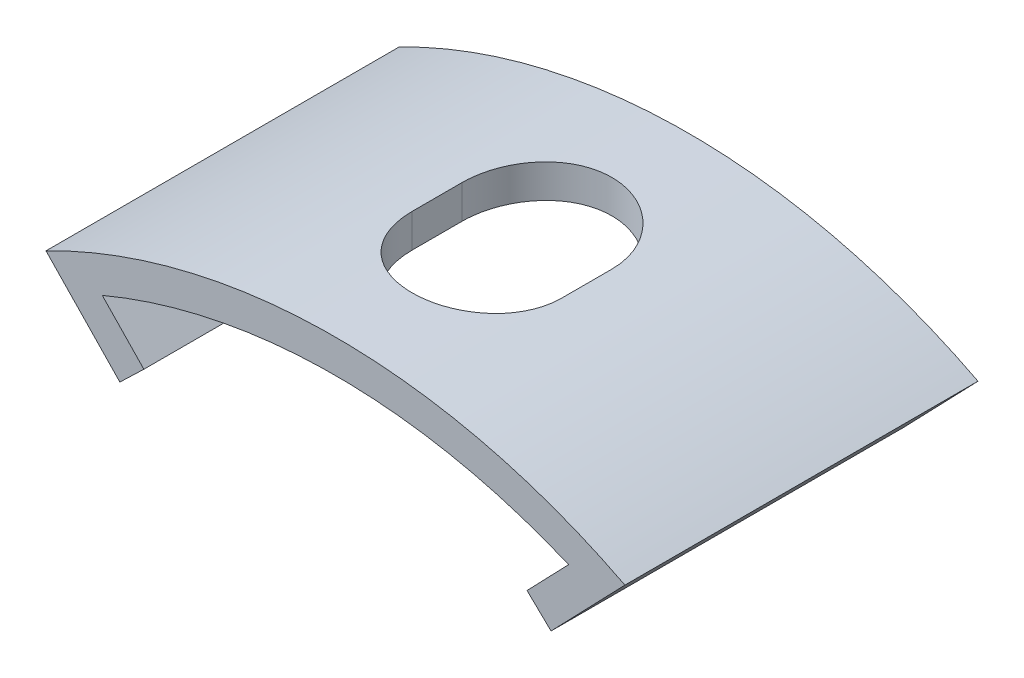
ISO-10303-21;
HEADER;
FILE_DESCRIPTION(('STEP AP214'),'2;1');
FILE_NAME('part.step','',(''),(''),'','','');
FILE_SCHEMA(('AUTOMOTIVE_DESIGN { 1 0 10303 214 1 1 1 1 }'));
ENDSEC;
DATA;
#1=APPLICATION_CONTEXT('core data for automotive mechanical design processes');
#2=APPLICATION_PROTOCOL_DEFINITION('international standard','automotive_design',2000,#1);
#3=PRODUCT_CONTEXT('',#1,'mechanical');
#4=PRODUCT('Part','Part','',(#3));
#5=PRODUCT_RELATED_PRODUCT_CATEGORY('part','',(#4));
#6=PRODUCT_DEFINITION_FORMATION('','',#4);
#7=PRODUCT_DEFINITION_CONTEXT('part definition',#1,'design');
#8=PRODUCT_DEFINITION('design','',#6,#7);
#9=PRODUCT_DEFINITION_SHAPE('','',#8);
#10=(LENGTH_UNIT() NAMED_UNIT(*) SI_UNIT(.MILLI.,.METRE.));
#11=(NAMED_UNIT(*) PLANE_ANGLE_UNIT() SI_UNIT($,.RADIAN.));
#12=(NAMED_UNIT(*) SI_UNIT($,.STERADIAN.) SOLID_ANGLE_UNIT());
#13=UNCERTAINTY_MEASURE_WITH_UNIT(LENGTH_MEASURE(1.E-05),#10,'distance_accuracy_value','');
#14=(GEOMETRIC_REPRESENTATION_CONTEXT(3) GLOBAL_UNCERTAINTY_ASSIGNED_CONTEXT((#13)) GLOBAL_UNIT_ASSIGNED_CONTEXT((#10,
#11,#12)) REPRESENTATION_CONTEXT('',''));
#15=CARTESIAN_POINT('',(0.,0.,0.));
#16=DIRECTION('',(0.,0.,1.));
#17=DIRECTION('',(1.,0.,0.));
#18=AXIS2_PLACEMENT_3D('',#15,#16,#17);
#19=CARTESIAN_POINT('',(0.,0.,5.3));
#20=DIRECTION('',(0.,0.,-1.));
#21=DIRECTION('',(-1.,0.,0.));
#22=AXIS2_PLACEMENT_3D('',#19,#20,#21);
#23=CYLINDRICAL_SURFACE('',#22,18.);
#24=CARTESIAN_POINT('',(0.,0.,-5.3));
#25=DIRECTION('',(0.,0.,1.));
#26=DIRECTION('',(1.,0.,0.));
#27=AXIS2_PLACEMENT_3D('',#24,#25,#26);
#28=CIRCLE('',#27,18.);
#29=CARTESIAN_POINT('',(7.,16.583123951777,-5.3));
#30=VERTEX_POINT('',#29);
#31=CARTESIAN_POINT('',(-7.,16.583123951777,-5.3));
#32=VERTEX_POINT('',#31);
#33=EDGE_CURVE('E227',#30,#32,#28,.T.);
#34=ORIENTED_EDGE('',*,*,#33,.F.);
#35=DIRECTION('',(0.,0.,-1.));
#36=VECTOR('',#35,1.);
#37=CARTESIAN_POINT('',(7.,16.583123951777,5.3));
#38=LINE('',#37,#36);
#39=CARTESIAN_POINT('',(7.,16.583123951777,5.3));
#40=VERTEX_POINT('',#39);
#41=EDGE_CURVE('E248',#40,#30,#38,.T.);
#42=ORIENTED_EDGE('',*,*,#41,.F.);
#43=CARTESIAN_POINT('',(0.,0.,5.3));
#44=DIRECTION('',(0.,0.,1.));
#45=DIRECTION('',(1.,0.,0.));
#46=AXIS2_PLACEMENT_3D('',#43,#44,#45);
#47=CIRCLE('',#46,18.);
#48=CARTESIAN_POINT('',(-7.,16.583123951777,5.3));
#49=VERTEX_POINT('',#48);
#50=EDGE_CURVE('E262',#40,#49,#47,.T.);
#51=ORIENTED_EDGE('',*,*,#50,.T.);
#52=DIRECTION('',(0.,0.,-1.));
#53=VECTOR('',#52,1.);
#54=CARTESIAN_POINT('',(-7.,16.583123951777,5.3));
#55=LINE('',#54,#53);
#56=EDGE_CURVE('E250',#49,#32,#55,.T.);
#57=ORIENTED_EDGE('',*,*,#56,.T.);
#58=EDGE_LOOP('',(#34,#42,#51,#57));
#59=FACE_BOUND('',#58,.T.);
#60=DIRECTION('',(0.,0.,-1.));
#61=VECTOR('',#60,1.);
#62=CARTESIAN_POINT('',(-2.25,17.858821349686,5.3));
#63=LINE('',#62,#61);
#64=CARTESIAN_POINT('',(-2.25,17.858821349686,-0.75));
#65=VERTEX_POINT('',#64);
#66=CARTESIAN_POINT('',(-2.25,17.858821349686,0.75));
#67=VERTEX_POINT('',#66);
#68=EDGE_CURVE('E175',#65,#67,#63,.F.);
#69=ORIENTED_EDGE('',*,*,#68,.T.);
#70=CARTESIAN_POINT('',(-2.25,17.858821349686,0.75));
#71=CARTESIAN_POINT('',(-2.24999987433453,17.8588194251762,0.813038421910983));
#72=CARTESIAN_POINT('',(-2.24734910280741,17.8591555464734,0.876046400447922));
#73=CARTESIAN_POINT('',(-2.2367760280738,17.860483614898,1.00160662816571));
#74=CARTESIAN_POINT('',(-2.22885413082701,17.8614755115204,1.06415891206719));
#75=CARTESIAN_POINT('',(-2.19726613729562,17.8653995354746,1.25031674039511));
#76=CARTESIAN_POINT('',(-2.16577747401027,17.8692801491553,1.37266760263013));
#77=CARTESIAN_POINT('',(-2.08284998220627,17.8791347069465,1.61029050708662));
#78=CARTESIAN_POINT('',(-2.03140462668968,17.8851093358599,1.72556021905842));
#79=CARTESIAN_POINT('',(-1.9100445468626,17.8984759849888,1.94583988541639));
#80=CARTESIAN_POINT('',(-1.8401312637343,17.9058678945916,2.0508506395056));
#81=CARTESIAN_POINT('',(-1.68341206734406,17.9212816202412,2.24819255503716));
#82=CARTESIAN_POINT('',(-1.59652505875848,17.9293063453518,2.34045906512173));
#83=CARTESIAN_POINT('',(-1.4084881592424,17.9450563047993,2.50915218989586));
#84=CARTESIAN_POINT('',(-1.30733609827826,17.9527814933416,2.58557639023872));
#85=CARTESIAN_POINT('',(-1.09323565451996,17.9670912133723,2.72063635035758));
#86=CARTESIAN_POINT('',(-0.980249611183446,17.9736719143119,2.77921284845707));
#87=CARTESIAN_POINT('',(-0.745954846626403,17.9849184109182,2.87653235189302));
#88=CARTESIAN_POINT('',(-0.624646927843693,17.98958439091,2.9152772664524));
#89=CARTESIAN_POINT('',(-0.377817617303712,17.9964554763961,2.97164252706326));
#90=CARTESIAN_POINT('',(-0.252321524361256,17.9986733000917,2.98937208399253));
#91=CARTESIAN_POINT('',(-0.000113958053788392,18.0004416380206,3.00354192890028));
#92=CARTESIAN_POINT('',(0.126597496892533,17.9999921926125,2.9999825390033));
#93=CARTESIAN_POINT('',(0.376889084753837,17.996486825208,2.97176228226685));
#94=CARTESIAN_POINT('',(0.500482760825345,17.9934454852649,2.94721946613686));
#95=CARTESIAN_POINT('',(0.741782589261214,17.9851144748259,2.87791368788275));
#96=CARTESIAN_POINT('',(0.859488661703709,17.9798247738188,2.83315045135721));
#97=CARTESIAN_POINT('',(1.08604033017171,17.9675661901284,2.72454804183679));
#98=CARTESIAN_POINT('',(1.19486100591024,17.9605927880744,2.66065741466114));
#99=CARTESIAN_POINT('',(1.40027581309508,17.9457473888532,2.51565390113486));
#100=CARTESIAN_POINT('',(1.49686990014344,17.9378753884233,2.43454095224834));
#101=CARTESIAN_POINT('',(1.67577600776006,17.9220509715218,2.25674697940169));
#102=CARTESIAN_POINT('',(1.75798787566357,17.9140983698413,2.15996517270914));
#103=CARTESIAN_POINT('',(1.90504051240019,17.8990587520914,1.95388697055325));
#104=CARTESIAN_POINT('',(1.96987611791605,17.8919719936451,1.84458686904738));
#105=CARTESIAN_POINT('',(2.08034030367041,17.8794655923308,1.61647074802186));
#106=CARTESIAN_POINT('',(2.12594942241975,17.8740476401532,1.49764523072224));
#107=CARTESIAN_POINT('',(2.19647134414845,17.8655197697751,1.25402518960859));
#108=CARTESIAN_POINT('',(2.22141531410094,17.8624063766198,1.12923995593975));
#109=CARTESIAN_POINT('',(2.24045955676342,17.860021010604,0.961297341119165));
#110=CARTESIAN_POINT('',(2.24403891993201,17.8595714574598,0.919080958189035));
#111=CARTESIAN_POINT('',(2.24880594188023,17.8589719767877,0.834582343684646));
#112=CARTESIAN_POINT('',(2.2499976086946,17.8588215471485,0.792300341894064));
#113=CARTESIAN_POINT('',(2.25,17.858821349686,0.75));
#114=B_SPLINE_CURVE_WITH_KNOTS('',3,(#70,#71,#72,#73,#74,#75,#76,#77,#78,#79,#80,#81,#82,#83,
#84,#85,#86,#87,#88,#89,#90,#91,#92,#93,#94,#95,#96,#97,#98,#99,#100,#101,#102,#103,#104,#105,
#106,#107,#108,#109,#110,#111,#112,#113),.UNSPECIFIED.,.F.,.F.,(4,2,2,2,2,2,2,2,2,2,2,2,2,2,2,2,
2,2,2,2,2,4),(0.,0.188998328147948,0.377982102132345,0.755226013918386,1.13259341054784,
1.50993136724195,1.88911828117894,2.2683629402761,2.6488534582724,3.02930733885574,
3.40777531688837,3.78623756831039,4.16258453387273,4.53893660680898,4.91631033520017,
5.29368543389454,5.6735920154572,6.05361136055525,6.43401445159375,6.81384277259916,
6.94090357256708,7.06775090645285),.UNSPECIFIED.);
#115=CARTESIAN_POINT('',(2.25,17.858821349686,0.75));
#116=VERTEX_POINT('',#115);
#117=EDGE_CURVE('E140',#67,#116,#114,.T.);
#118=ORIENTED_EDGE('',*,*,#117,.T.);
#119=DIRECTION('',(0.,0.,-1.));
#120=VECTOR('',#119,1.);
#121=CARTESIAN_POINT('',(2.25,17.858821349686,5.3));
#122=LINE('',#121,#120);
#123=CARTESIAN_POINT('',(2.25,17.858821349686,-0.75));
#124=VERTEX_POINT('',#123);
#125=EDGE_CURVE('E174',#116,#124,#122,.T.);
#126=ORIENTED_EDGE('',*,*,#125,.T.);
#127=CARTESIAN_POINT('',(2.25,17.858821349686,-0.75));
#128=CARTESIAN_POINT('',(2.24999987433453,17.8588194251762,-0.813038421910983));
#129=CARTESIAN_POINT('',(2.24734910280741,17.8591555464734,-0.876046400447922));
#130=CARTESIAN_POINT('',(2.2367760280738,17.860483614898,-1.00160662816571));
#131=CARTESIAN_POINT('',(2.22885413082701,17.8614755115204,-1.06415891206719));
#132=CARTESIAN_POINT('',(2.19726613729562,17.8653995354746,-1.25031674039511));
#133=CARTESIAN_POINT('',(2.16577747401027,17.8692801491553,-1.37266760263013));
#134=CARTESIAN_POINT('',(2.08284998220627,17.8791347069465,-1.61029050708662));
#135=CARTESIAN_POINT('',(2.03140462668968,17.8851093358599,-1.72556021905842));
#136=CARTESIAN_POINT('',(1.91004454686259,17.8984759849888,-1.94583988541639));
#137=CARTESIAN_POINT('',(1.8401312637343,17.9058678945916,-2.0508506395056));
#138=CARTESIAN_POINT('',(1.68341206734406,17.9212816202412,-2.24819255503716));
#139=CARTESIAN_POINT('',(1.59652505875848,17.9293063453518,-2.34045906512173));
#140=CARTESIAN_POINT('',(1.4084881592424,17.9450563047993,-2.50915218989586));
#141=CARTESIAN_POINT('',(1.30733609827826,17.9527814933416,-2.58557639023872));
#142=CARTESIAN_POINT('',(1.09323565451996,17.9670912133723,-2.72063635035758));
#143=CARTESIAN_POINT('',(0.980249611183446,17.9736719143119,-2.77921284845707));
#144=CARTESIAN_POINT('',(0.745954846626401,17.9849184109182,-2.87653235189302));
#145=CARTESIAN_POINT('',(0.624646927843692,17.98958439091,-2.9152772664524));
#146=CARTESIAN_POINT('',(0.377817617303711,17.9964554763961,-2.97164252706327));
#147=CARTESIAN_POINT('',(0.252321524361255,17.9986733000917,-2.98937208399253));
#148=CARTESIAN_POINT('',(0.000113958053786956,18.0004416380206,-3.00354192890028));
#149=CARTESIAN_POINT('',(-0.126597496892535,17.9999921926125,-2.9999825390033));
#150=CARTESIAN_POINT('',(-0.376889084753838,17.996486825208,-2.97176228226685));
#151=CARTESIAN_POINT('',(-0.500482760825348,17.9934454852649,-2.94721946613686));
#152=CARTESIAN_POINT('',(-0.741782589261217,17.9851144748259,-2.87791368788275));
#153=CARTESIAN_POINT('',(-0.859488661703711,17.9798247738188,-2.83315045135721));
#154=CARTESIAN_POINT('',(-1.08604033017171,17.9675661901284,-2.72454804183679));
#155=CARTESIAN_POINT('',(-1.19486100591024,17.9605927880744,-2.66065741466114));
#156=CARTESIAN_POINT('',(-1.40027581309508,17.9457473888532,-2.51565390113486));
#157=CARTESIAN_POINT('',(-1.49686990014345,17.9378753884233,-2.43454095224834));
#158=CARTESIAN_POINT('',(-1.67577600776006,17.9220509715218,-2.25674697940169));
#159=CARTESIAN_POINT('',(-1.75798787566357,17.9140983698413,-2.15996517270914));
#160=CARTESIAN_POINT('',(-1.90504051240019,17.8990587520914,-1.95388697055325));
#161=CARTESIAN_POINT('',(-1.96987611791605,17.8919719936451,-1.84458686904739));
#162=CARTESIAN_POINT('',(-2.08034030367041,17.8794655923308,-1.61647074802187));
#163=CARTESIAN_POINT('',(-2.12594942241975,17.8740476401532,-1.49764523072224));
#164=CARTESIAN_POINT('',(-2.19647134414845,17.8655197697751,-1.25402518960859));
#165=CARTESIAN_POINT('',(-2.22141531410094,17.8624063766198,-1.12923995593975));
#166=CARTESIAN_POINT('',(-2.24045955676343,17.860021010604,-0.961297341119165));
#167=CARTESIAN_POINT('',(-2.24403891993201,17.8595714574598,-0.919080958189035));
#168=CARTESIAN_POINT('',(-2.24880594188023,17.8589719767877,-0.834582343684645));
#169=CARTESIAN_POINT('',(-2.24999760869461,17.8588215471485,-0.792300341894064));
#170=CARTESIAN_POINT('',(-2.25,17.858821349686,-0.749999999999999));
#171=B_SPLINE_CURVE_WITH_KNOTS('',3,(#127,#128,#129,#130,#131,#132,#133,#134,#135,#136,#137,
#138,#139,#140,#141,#142,#143,#144,#145,#146,#147,#148,#149,#150,#151,#152,#153,#154,#155,#156,
#157,#158,#159,#160,#161,#162,#163,#164,#165,#166,#167,#168,#169,#170),.UNSPECIFIED.,.F.,.F.,(4,
2,2,2,2,2,2,2,2,2,2,2,2,2,2,2,2,2,2,2,2,4),(0.,0.188998328147948,0.377982102132345,
0.755226013918386,1.13259341054784,1.50993136724195,1.88911828117894,2.2683629402761,
2.6488534582724,3.02930733885574,3.40777531688837,3.78623756831039,4.16258453387273,
4.53893660680899,4.91631033520017,5.29368543389454,5.6735920154572,6.05361136055525,
6.43401445159375,6.81384277259917,6.94090357256708,7.06775090645286),.UNSPECIFIED.);
#172=EDGE_CURVE('E166',#124,#65,#171,.T.);
#173=ORIENTED_EDGE('',*,*,#172,.T.);
#174=EDGE_LOOP('',(#69,#118,#126,#173));
#175=FACE_BOUND('',#174,.T.);
#176=ADVANCED_FACE('F37',(#59,#175),#23,.F.);
#177=CARTESIAN_POINT('',(0.,0.,5.3));
#178=DIRECTION('',(0.,0.,-1.));
#179=DIRECTION('',(-1.,0.,0.));
#180=AXIS2_PLACEMENT_3D('',#177,#178,#179);
#181=CYLINDRICAL_SURFACE('',#180,19.);
#182=CARTESIAN_POINT('',(0.,0.,-5.3));
#183=DIRECTION('',(0.,0.,1.));
#184=DIRECTION('',(1.,0.,0.));
#185=AXIS2_PLACEMENT_3D('',#182,#183,#184);
#186=CIRCLE('',#185,19.);
#187=CARTESIAN_POINT('',(8.68969024076547,16.896428129032,-5.3));
#188=VERTEX_POINT('',#187);
#189=CARTESIAN_POINT('',(-8.68969024076547,16.896428129032,-5.3));
#190=VERTEX_POINT('',#189);
#191=EDGE_CURVE('E212',#188,#190,#186,.T.);
#192=ORIENTED_EDGE('',*,*,#191,.T.);
#193=DIRECTION('',(0.,0.,-1.));
#194=VECTOR('',#193,1.);
#195=CARTESIAN_POINT('',(-8.68969024076547,16.896428129032,5.3));
#196=LINE('',#195,#194);
#197=CARTESIAN_POINT('',(-8.68969024076547,16.896428129032,5.3));
#198=VERTEX_POINT('',#197);
#199=EDGE_CURVE('E239',#198,#190,#196,.T.);
#200=ORIENTED_EDGE('',*,*,#199,.F.);
#201=CARTESIAN_POINT('',(0.,0.,5.3));
#202=DIRECTION('',(0.,0.,1.));
#203=DIRECTION('',(1.,0.,0.));
#204=AXIS2_PLACEMENT_3D('',#201,#202,#203);
#205=CIRCLE('',#204,19.);
#206=CARTESIAN_POINT('',(8.68969024076547,16.896428129032,5.3));
#207=VERTEX_POINT('',#206);
#208=EDGE_CURVE('E223',#207,#198,#205,.T.);
#209=ORIENTED_EDGE('',*,*,#208,.F.);
#210=DIRECTION('',(0.,0.,-1.));
#211=VECTOR('',#210,1.);
#212=CARTESIAN_POINT('',(8.68969024076547,16.896428129032,5.3));
#213=LINE('',#212,#211);
#214=EDGE_CURVE('E241',#207,#188,#213,.T.);
#215=ORIENTED_EDGE('',*,*,#214,.T.);
#216=EDGE_LOOP('',(#192,#200,#209,#215));
#217=FACE_BOUND('',#216,.T.);
#218=CARTESIAN_POINT('',(-2.25,18.8663059447259,0.75));
#219=CARTESIAN_POINT('',(-2.24999984413377,18.866304126766,0.813065444008957));
#220=CARTESIAN_POINT('',(-2.24734683038286,18.8666225662772,0.876100456864434));
#221=CARTESIAN_POINT('',(-2.23676461239271,18.8678808036718,1.00171506453087));
#222=CARTESIAN_POINT('',(-2.22883579857183,18.8688205555769,1.06429469269468));
#223=CARTESIAN_POINT('',(-2.19721906511498,18.8725384514377,1.25053881791379));
#224=CARTESIAN_POINT('',(-2.16570059497972,18.876215376971,1.37294884829296));
#225=CARTESIAN_POINT('',(-2.08268940200505,18.8855534165936,1.61068939978139));
#226=CARTESIAN_POINT('',(-2.0311898629049,18.8912152077282,1.72601748941873));
#227=CARTESIAN_POINT('',(-1.9096974928355,18.9038824486064,1.94640209506089));
#228=CARTESIAN_POINT('',(-1.83970632808281,18.9108877772729,2.05145953535055));
#229=CARTESIAN_POINT('',(-1.68285058840054,18.9254914459535,2.2488249331985));
#230=CARTESIAN_POINT('',(-1.59591314397453,18.9330922589904,2.34107477466332));
#231=CARTESIAN_POINT('',(-1.40777799267168,18.9480090918228,2.50972207917964));
#232=CARTESIAN_POINT('',(-1.3065781169975,18.9553250680887,2.5861171269167));
#233=CARTESIAN_POINT('',(-1.09242950974802,18.9688725160587,2.72108165180554));
#234=CARTESIAN_POINT('',(-0.979447124621018,18.975100737433,2.77959808332987));
#235=CARTESIAN_POINT('',(-0.745179993513777,18.985743053388,2.87680195802174));
#236=CARTESIAN_POINT('',(-0.623896020192753,18.9901573165335,2.91549124373732));
#237=CARTESIAN_POINT('',(-0.377065646956689,18.9966571872975,2.97177169513252));
#238=CARTESIAN_POINT('',(-0.251541895868488,18.9987536150932,2.98946092262533));
#239=CARTESIAN_POINT('',(0.000711970235301823,19.0004185383706,3.00354301109507));
#240=CARTESIAN_POINT('',(0.127442071650238,18.9999870623187,2.99993611188586));
#241=CARTESIAN_POINT('',(0.377837656700778,18.9966534829824,2.9716064392706));
#242=CARTESIAN_POINT('',(0.501515328123363,18.9937637890536,2.94698972369523));
#243=CARTESIAN_POINT('',(0.742970891810421,18.9858525077212,2.87750493446024));
#244=CARTESIAN_POINT('',(0.860748713087663,18.9808308946732,2.83263661719752));
#245=CARTESIAN_POINT('',(1.08739417162659,18.9691986105771,2.72380756445231));
#246=CARTESIAN_POINT('',(1.19623924436736,18.9625840719268,2.65980026694911));
#247=CARTESIAN_POINT('',(1.4016780442815,18.9485069935124,2.51454671739229));
#248=CARTESIAN_POINT('',(1.49827179267252,18.9410444552171,2.43330049519482));
#249=CARTESIAN_POINT('',(1.67708146493049,18.9260538253829,2.25529359456109));
#250=CARTESIAN_POINT('',(1.75920752476244,18.9185256093612,2.15844264223406));
#251=CARTESIAN_POINT('',(1.90607611238423,18.9042941674795,1.95224612854428));
#252=CARTESIAN_POINT('',(1.97081344036131,18.8975911887167,1.84289684366567));
#253=CARTESIAN_POINT('',(2.08106902250753,18.8857682243098,1.61471612700434));
#254=CARTESIAN_POINT('',(2.12656907316942,18.8806497392327,1.49587584007561));
#255=CARTESIAN_POINT('',(2.19687527764837,18.872599510043,1.25225438931704));
#256=CARTESIAN_POINT('',(2.22171263247485,18.8696644696046,1.12748248463915));
#257=CARTESIAN_POINT('',(2.2405901012447,18.8674260294376,0.959849720419371));
#258=CARTESIAN_POINT('',(2.24412051000476,18.8670062867246,0.917921350010672));
#259=CARTESIAN_POINT('',(2.24882229454311,18.8664465763562,0.834001213167836));
#260=CARTESIAN_POINT('',(2.24999761940603,18.8663061403527,0.792009671218649));
#261=CARTESIAN_POINT('',(2.25,18.8663059447259,0.75));
#262=B_SPLINE_CURVE_WITH_KNOTS('',3,(#218,#219,#220,#221,#222,#223,#224,#225,#226,#227,#228,
#229,#230,#231,#232,#233,#234,#235,#236,#237,#238,#239,#240,#241,#242,#243,#244,#245,#246,#247,
#248,#249,#250,#251,#252,#253,#254,#255,#256,#257,#258,#259,#260,#261),.UNSPECIFIED.,.F.,.F.,(4,
2,2,2,2,2,2,2,2,2,2,2,2,2,2,2,2,2,2,2,2,4),(0.,0.189079425503063,0.378144860356892,
0.755564078222733,1.13311216071341,1.510626235245,1.88980094259794,2.26903337097799,
2.64938028868305,3.02969185411809,3.40822044347497,3.7867447702622,4.16336952684837,
4.53999881391062,4.91755193870435,5.29510440961777,5.67492510427658,6.05485925190686,
6.4351521165356,6.81486968499599,6.94105757499129,7.06703369118151),.UNSPECIFIED.);
#263=CARTESIAN_POINT('',(-2.25,18.8663059447259,0.75));
#264=VERTEX_POINT('',#263);
#265=CARTESIAN_POINT('',(2.25,18.8663059447259,0.75));
#266=VERTEX_POINT('',#265);
#267=EDGE_CURVE('E11',#264,#266,#262,.T.);
#268=ORIENTED_EDGE('',*,*,#267,.F.);
#269=DIRECTION('',(0.,0.,-1.));
#270=VECTOR('',#269,1.);
#271=CARTESIAN_POINT('',(-2.25,18.8663059447259,5.3));
#272=LINE('',#271,#270);
#273=CARTESIAN_POINT('',(-2.25,18.8663059447259,-0.750000000000001));
#274=VERTEX_POINT('',#273);
#275=EDGE_CURVE('E127',#274,#264,#272,.F.);
#276=ORIENTED_EDGE('',*,*,#275,.F.);
#277=CARTESIAN_POINT('',(2.25,18.8663059447259,-0.75));
#278=CARTESIAN_POINT('',(2.24999984413377,18.866304126766,-0.813065444008957));
#279=CARTESIAN_POINT('',(2.24734683038285,18.8666225662772,-0.876100456864433));
#280=CARTESIAN_POINT('',(2.23676461239271,18.8678808036718,-1.00171506453087));
#281=CARTESIAN_POINT('',(2.22883579857183,18.8688205555769,-1.06429469269468));
#282=CARTESIAN_POINT('',(2.19721906511497,18.8725384514377,-1.25053881791379));
#283=CARTESIAN_POINT('',(2.16570059497971,18.876215376971,-1.37294884829296));
#284=CARTESIAN_POINT('',(2.08268940200505,18.8855534165936,-1.61068939978139));
#285=CARTESIAN_POINT('',(2.0311898629049,18.8912152077282,-1.72601748941873));
#286=CARTESIAN_POINT('',(1.9096974928355,18.9038824486064,-1.94640209506089));
#287=CARTESIAN_POINT('',(1.8397063280828,18.9108877772729,-2.05145953535055));
#288=CARTESIAN_POINT('',(1.68285058840054,18.9254914459535,-2.2488249331985));
#289=CARTESIAN_POINT('',(1.59591314397453,18.9330922589904,-2.34107477466332));
#290=CARTESIAN_POINT('',(1.40777799267168,18.9480090918228,-2.50972207917964));
#291=CARTESIAN_POINT('',(1.30657811699749,18.9553250680887,-2.5861171269167));
#292=CARTESIAN_POINT('',(1.09242950974802,18.9688725160587,-2.72108165180554));
#293=CARTESIAN_POINT('',(0.979447124621017,18.975100737433,-2.77959808332987));
#294=CARTESIAN_POINT('',(0.745179993513776,18.985743053388,-2.87680195802174));
#295=CARTESIAN_POINT('',(0.623896020192752,18.9901573165335,-2.91549124373732));
#296=CARTESIAN_POINT('',(0.377065646956688,18.9966571872975,-2.97177169513252));
#297=CARTESIAN_POINT('',(0.251541895868486,18.9987536150932,-2.98946092262533));
#298=CARTESIAN_POINT('',(-0.000711970235303124,19.0004185383706,-3.00354301109507));
#299=CARTESIAN_POINT('',(-0.127442071650239,18.9999870623187,-2.99993611188586));
#300=CARTESIAN_POINT('',(-0.377837656700779,18.9966534829824,-2.9716064392706));
#301=CARTESIAN_POINT('',(-0.501515328123365,18.9937637890536,-2.94698972369523));
#302=CARTESIAN_POINT('',(-0.742970891810423,18.9858525077212,-2.87750493446024));
#303=CARTESIAN_POINT('',(-0.860748713087664,18.9808308946732,-2.83263661719752));
#304=CARTESIAN_POINT('',(-1.08739417162659,18.9691986105771,-2.72380756445231));
#305=CARTESIAN_POINT('',(-1.19623924436736,18.9625840719268,-2.65980026694912));
#306=CARTESIAN_POINT('',(-1.4016780442815,18.9485069935124,-2.51454671739229));
#307=CARTESIAN_POINT('',(-1.49827179267252,18.9410444552171,-2.43330049519482));
#308=CARTESIAN_POINT('',(-1.67708146493049,18.9260538253829,-2.25529359456109));
#309=CARTESIAN_POINT('',(-1.75920752476244,18.9185256093612,-2.15844264223406));
#310=CARTESIAN_POINT('',(-1.90607611238423,18.9042941674794,-1.95224612854428));
#311=CARTESIAN_POINT('',(-1.97081344036131,18.8975911887167,-1.84289684366567));
#312=CARTESIAN_POINT('',(-2.08106902250753,18.8857682243098,-1.61471612700434));
#313=CARTESIAN_POINT('',(-2.12656907316942,18.8806497392328,-1.49587584007561));
#314=CARTESIAN_POINT('',(-2.19687527764837,18.872599510043,-1.25225438931704));
#315=CARTESIAN_POINT('',(-2.22171263247485,18.8696644696046,-1.12748248463915));
#316=CARTESIAN_POINT('',(-2.24059010124471,18.8674260294376,-0.959849720419372));
#317=CARTESIAN_POINT('',(-2.24412051000476,18.8670062867246,-0.917921350010673));
#318=CARTESIAN_POINT('',(-2.24882229454311,18.8664465763562,-0.834001213167836));
#319=CARTESIAN_POINT('',(-2.24999761940603,18.8663061403527,-0.792009671218648));
#320=CARTESIAN_POINT('',(-2.25,18.8663059447259,-0.749999999999999));
#321=B_SPLINE_CURVE_WITH_KNOTS('',3,(#277,#278,#279,#280,#281,#282,#283,#284,#285,#286,#287,
#288,#289,#290,#291,#292,#293,#294,#295,#296,#297,#298,#299,#300,#301,#302,#303,#304,#305,#306,
#307,#308,#309,#310,#311,#312,#313,#314,#315,#316,#317,#318,#319,#320),.UNSPECIFIED.,.F.,.F.,(4,
2,2,2,2,2,2,2,2,2,2,2,2,2,2,2,2,2,2,2,2,4),(0.,0.189079425503062,0.378144860356892,
0.755564078222733,1.13311216071341,1.510626235245,1.88980094259794,2.26903337097799,
2.64938028868305,3.02969185411809,3.40822044347497,3.7867447702622,4.16336952684837,
4.53999881391062,4.91755193870435,5.29510440961777,5.67492510427658,6.05485925190686,
6.4351521165356,6.814869684996,6.9410575749913,7.06703369118151),.UNSPECIFIED.);
#322=CARTESIAN_POINT('',(2.25,18.8663059447259,-0.75));
#323=VERTEX_POINT('',#322);
#324=EDGE_CURVE('E132',#323,#274,#321,.T.);
#325=ORIENTED_EDGE('',*,*,#324,.F.);
#326=DIRECTION('',(0.,0.,-1.));
#327=VECTOR('',#326,1.);
#328=CARTESIAN_POINT('',(2.25,18.8663059447259,5.3));
#329=LINE('',#328,#327);
#330=EDGE_CURVE('E50',#266,#323,#329,.T.);
#331=ORIENTED_EDGE('',*,*,#330,.F.);
#332=EDGE_LOOP('',(#268,#276,#325,#331));
#333=FACE_BOUND('',#332,.T.);
#334=ADVANCED_FACE('F144',(#217,#333),#181,.T.);
#335=CARTESIAN_POINT('',(-7.72042085561147,15.889586792859,5.3));
#336=DIRECTION('',(0.720420855611469,0.693537158917991,0.));
#337=DIRECTION('',(-0.693537158917991,0.720420855611469,0.));
#338=AXIS2_PLACEMENT_3D('',#335,#336,#337);
#339=PLANE('',#338);
#340=DIRECTION('',(0.693537158917991,-0.720420855611469,0.));
#341=VECTOR('',#340,1.);
#342=CARTESIAN_POINT('',(-7.72042085561147,15.889586792859,-5.3));
#343=LINE('',#342,#341);
#344=CARTESIAN_POINT('',(-6.47205396955908,14.5928292527584,-5.3));
#345=VERTEX_POINT('',#344);
#346=EDGE_CURVE('E191',#190,#345,#343,.T.);
#347=ORIENTED_EDGE('',*,*,#346,.T.);
#348=DIRECTION('',(0.,0.,-1.));
#349=VECTOR('',#348,1.);
#350=CARTESIAN_POINT('',(-6.47205396955908,14.5928292527584,5.3));
#351=LINE('',#350,#349);
#352=CARTESIAN_POINT('',(-6.47205396955908,14.5928292527584,5.3));
#353=VERTEX_POINT('',#352);
#354=EDGE_CURVE('E133',#353,#345,#351,.T.);
#355=ORIENTED_EDGE('',*,*,#354,.F.);
#356=DIRECTION('',(0.693537158917991,-0.720420855611469,0.));
#357=VECTOR('',#356,1.);
#358=CARTESIAN_POINT('',(-7.72042085561147,15.889586792859,5.3));
#359=LINE('',#358,#357);
#360=EDGE_CURVE('E192',#198,#353,#359,.T.);
#361=ORIENTED_EDGE('',*,*,#360,.F.);
#362=ORIENTED_EDGE('',*,*,#199,.T.);
#363=EDGE_LOOP('',(#347,#355,#361,#362));
#364=FACE_BOUND('',#363,.T.);
#365=ADVANCED_FACE('F39',(#364),#339,.F.);
#366=CARTESIAN_POINT('',(-5.75163311394761,15.2863664116764,5.3));
#367=DIRECTION('',(0.693537158917991,-0.720420855611469,0.));
#368=DIRECTION('',(0.720420855611469,0.693537158917991,0.));
#369=AXIS2_PLACEMENT_3D('',#366,#367,#368);
#370=PLANE('',#369);
#371=DIRECTION('',(-0.720420855611469,-0.693537158917991,0.));
#372=VECTOR('',#371,1.);
#373=CARTESIAN_POINT('',(-5.75163311394761,15.2863664116764,-5.3));
#374=LINE('',#373,#372);
#375=CARTESIAN_POINT('',(-5.75163311394761,15.2863664116764,-5.3));
#376=VERTEX_POINT('',#375);
#377=EDGE_CURVE('E215',#376,#345,#374,.T.);
#378=ORIENTED_EDGE('',*,*,#377,.F.);
#379=DIRECTION('',(0.,0.,-1.));
#380=VECTOR('',#379,1.);
#381=CARTESIAN_POINT('',(-5.75163311394761,15.2863664116764,5.3));
#382=LINE('',#381,#380);
#383=CARTESIAN_POINT('',(-5.75163311394761,15.2863664116764,5.3));
#384=VERTEX_POINT('',#383);
#385=EDGE_CURVE('E252',#384,#376,#382,.T.);
#386=ORIENTED_EDGE('',*,*,#385,.F.);
#387=DIRECTION('',(-0.720420855611469,-0.693537158917991,0.));
#388=VECTOR('',#387,1.);
#389=CARTESIAN_POINT('',(-5.75163311394761,15.2863664116764,5.3));
#390=LINE('',#389,#388);
#391=EDGE_CURVE('E257',#384,#353,#390,.T.);
#392=ORIENTED_EDGE('',*,*,#391,.T.);
#393=ORIENTED_EDGE('',*,*,#354,.T.);
#394=EDGE_LOOP('',(#378,#386,#392,#393));
#395=FACE_BOUND('',#394,.T.);
#396=ADVANCED_FACE('F255',(#395),#370,.T.);
#397=CARTESIAN_POINT('',(-7.,16.583123951777,5.3));
#398=DIRECTION('',(0.720420855611469,0.693537158917991,0.));
#399=DIRECTION('',(-0.693537158917991,0.720420855611469,0.));
#400=AXIS2_PLACEMENT_3D('',#397,#398,#399);
#401=PLANE('',#400);
#402=DIRECTION('',(0.693537158917991,-0.720420855611469,0.));
#403=VECTOR('',#402,1.);
#404=CARTESIAN_POINT('',(-7.,16.583123951777,-5.3));
#405=LINE('',#404,#403);
#406=EDGE_CURVE('E220',#32,#376,#405,.T.);
#407=ORIENTED_EDGE('',*,*,#406,.F.);
#408=ORIENTED_EDGE('',*,*,#56,.F.);
#409=DIRECTION('',(0.693537158917991,-0.720420855611469,0.));
#410=VECTOR('',#409,1.);
#411=CARTESIAN_POINT('',(-7.,16.583123951777,5.3));
#412=LINE('',#411,#410);
#413=EDGE_CURVE('E260',#49,#384,#412,.T.);
#414=ORIENTED_EDGE('',*,*,#413,.T.);
#415=ORIENTED_EDGE('',*,*,#385,.T.);
#416=EDGE_LOOP('',(#407,#408,#414,#415));
#417=FACE_BOUND('',#416,.T.);
#418=ADVANCED_FACE('F185',(#417),#401,.T.);
#419=CARTESIAN_POINT('',(7.,16.583123951777,5.3));
#420=DIRECTION('',(-0.720420855611469,0.693537158917991,0.));
#421=DIRECTION('',(-0.693537158917991,-0.720420855611469,0.));
#422=AXIS2_PLACEMENT_3D('',#419,#420,#421);
#423=PLANE('',#422);
#424=DIRECTION('',(0.693537158917991,0.720420855611469,0.));
#425=VECTOR('',#424,1.);
#426=CARTESIAN_POINT('',(7.,16.583123951777,-5.3));
#427=LINE('',#426,#425);
#428=CARTESIAN_POINT('',(5.75163311394762,15.2863664116764,-5.3));
#429=VERTEX_POINT('',#428);
#430=EDGE_CURVE('E230',#429,#30,#427,.T.);
#431=ORIENTED_EDGE('',*,*,#430,.F.);
#432=DIRECTION('',(0.,0.,-1.));
#433=VECTOR('',#432,1.);
#434=CARTESIAN_POINT('',(5.75163311394762,15.2863664116764,5.3));
#435=LINE('',#434,#433);
#436=CARTESIAN_POINT('',(5.75163311394762,15.2863664116764,5.3));
#437=VERTEX_POINT('',#436);
#438=EDGE_CURVE('E246',#437,#429,#435,.T.);
#439=ORIENTED_EDGE('',*,*,#438,.F.);
#440=DIRECTION('',(0.693537158917991,0.720420855611469,0.));
#441=VECTOR('',#440,1.);
#442=CARTESIAN_POINT('',(7.,16.583123951777,5.3));
#443=LINE('',#442,#441);
#444=EDGE_CURVE('E267',#437,#40,#443,.T.);
#445=ORIENTED_EDGE('',*,*,#444,.T.);
#446=ORIENTED_EDGE('',*,*,#41,.T.);
#447=EDGE_LOOP('',(#431,#439,#445,#446));
#448=FACE_BOUND('',#447,.T.);
#449=ADVANCED_FACE('F183',(#448),#423,.T.);
#450=CARTESIAN_POINT('',(6.47205396955909,14.5928292527584,5.3));
#451=DIRECTION('',(-0.693537158917991,-0.720420855611469,0.));
#452=DIRECTION('',(0.720420855611469,-0.693537158917991,0.));
#453=AXIS2_PLACEMENT_3D('',#450,#451,#452);
#454=PLANE('',#453);
#455=DIRECTION('',(-0.720420855611469,0.693537158917991,0.));
#456=VECTOR('',#455,1.);
#457=CARTESIAN_POINT('',(6.47205396955909,14.5928292527584,-5.3));
#458=LINE('',#457,#456);
#459=CARTESIAN_POINT('',(6.47205396955909,14.5928292527584,-5.3));
#460=VERTEX_POINT('',#459);
#461=EDGE_CURVE('E233',#460,#429,#458,.T.);
#462=ORIENTED_EDGE('',*,*,#461,.F.);
#463=DIRECTION('',(0.,0.,-1.));
#464=VECTOR('',#463,1.);
#465=CARTESIAN_POINT('',(6.47205396955909,14.5928292527584,5.3));
#466=LINE('',#465,#464);
#467=CARTESIAN_POINT('',(6.47205396955909,14.5928292527584,5.3));
#468=VERTEX_POINT('',#467);
#469=EDGE_CURVE('E244',#468,#460,#466,.T.);
#470=ORIENTED_EDGE('',*,*,#469,.F.);
#471=DIRECTION('',(-0.720420855611469,0.693537158917991,0.));
#472=VECTOR('',#471,1.);
#473=CARTESIAN_POINT('',(6.47205396955909,14.5928292527584,5.3));
#474=LINE('',#473,#472);
#475=EDGE_CURVE('E270',#468,#437,#474,.T.);
#476=ORIENTED_EDGE('',*,*,#475,.T.);
#477=ORIENTED_EDGE('',*,*,#438,.T.);
#478=EDGE_LOOP('',(#462,#470,#476,#477));
#479=FACE_BOUND('',#478,.T.);
#480=ADVANCED_FACE('F281',(#479),#454,.T.);
#481=CARTESIAN_POINT('',(7.72042085561147,15.889586792859,5.3));
#482=DIRECTION('',(-0.720420855611469,0.693537158917991,0.));
#483=DIRECTION('',(-0.693537158917991,-0.720420855611469,0.));
#484=AXIS2_PLACEMENT_3D('',#481,#482,#483);
#485=PLANE('',#484);
#486=DIRECTION('',(0.693537158917991,0.720420855611469,0.));
#487=VECTOR('',#486,1.);
#488=CARTESIAN_POINT('',(7.72042085561147,15.889586792859,-5.3));
#489=LINE('',#488,#487);
#490=EDGE_CURVE('E236',#460,#188,#489,.T.);
#491=ORIENTED_EDGE('',*,*,#490,.T.);
#492=ORIENTED_EDGE('',*,*,#214,.F.);
#493=DIRECTION('',(0.693537158917991,0.720420855611469,0.));
#494=VECTOR('',#493,1.);
#495=CARTESIAN_POINT('',(7.72042085561147,15.889586792859,5.3));
#496=LINE('',#495,#494);
#497=EDGE_CURVE('E272',#468,#207,#496,.T.);
#498=ORIENTED_EDGE('',*,*,#497,.F.);
#499=ORIENTED_EDGE('',*,*,#469,.T.);
#500=EDGE_LOOP('',(#491,#492,#498,#499));
#501=FACE_BOUND('',#500,.T.);
#502=ADVANCED_FACE('F201',(#501),#485,.F.);
#503=CARTESIAN_POINT('',(0.,0.,5.3));
#504=DIRECTION('',(0.,0.,1.));
#505=DIRECTION('',(1.,0.,0.));
#506=AXIS2_PLACEMENT_3D('',#503,#504,#505);
#507=PLANE('',#506);
#508=ORIENTED_EDGE('',*,*,#360,.T.);
#509=ORIENTED_EDGE('',*,*,#391,.F.);
#510=ORIENTED_EDGE('',*,*,#413,.F.);
#511=ORIENTED_EDGE('',*,*,#50,.F.);
#512=ORIENTED_EDGE('',*,*,#444,.F.);
#513=ORIENTED_EDGE('',*,*,#475,.F.);
#514=ORIENTED_EDGE('',*,*,#497,.T.);
#515=ORIENTED_EDGE('',*,*,#208,.T.);
#516=EDGE_LOOP('',(#508,#509,#510,#511,#512,#513,#514,#515));
#517=FACE_BOUND('',#516,.T.);
#518=ADVANCED_FACE('F198',(#517),#507,.T.);
#519=CARTESIAN_POINT('',(0.,0.,-5.3));
#520=DIRECTION('',(0.,0.,1.));
#521=DIRECTION('',(1.,0.,0.));
#522=AXIS2_PLACEMENT_3D('',#519,#520,#521);
#523=PLANE('',#522);
#524=ORIENTED_EDGE('',*,*,#346,.F.);
#525=ORIENTED_EDGE('',*,*,#191,.F.);
#526=ORIENTED_EDGE('',*,*,#490,.F.);
#527=ORIENTED_EDGE('',*,*,#461,.T.);
#528=ORIENTED_EDGE('',*,*,#430,.T.);
#529=ORIENTED_EDGE('',*,*,#33,.T.);
#530=ORIENTED_EDGE('',*,*,#406,.T.);
#531=ORIENTED_EDGE('',*,*,#377,.T.);
#532=EDGE_LOOP('',(#524,#525,#526,#527,#528,#529,#530,#531));
#533=FACE_BOUND('',#532,.T.);
#534=ADVANCED_FACE('F197',(#533),#523,.F.);
#535=CARTESIAN_POINT('',(0.,23.5,0.75));
#536=DIRECTION('',(0.,-1.,0.));
#537=DIRECTION('',(0.,0.,-1.));
#538=AXIS2_PLACEMENT_3D('',#535,#536,#537);
#539=CYLINDRICAL_SURFACE('',#538,2.25);
#540=DIRECTION('',(0.,-1.,0.));
#541=VECTOR('',#540,1.);
#542=CARTESIAN_POINT('',(-2.25,23.5,0.75));
#543=LINE('',#542,#541);
#544=EDGE_CURVE('E57',#264,#67,#543,.T.);
#545=ORIENTED_EDGE('',*,*,#544,.F.);
#546=ORIENTED_EDGE('',*,*,#267,.T.);
#547=DIRECTION('',(0.,-1.,0.));
#548=VECTOR('',#547,1.);
#549=CARTESIAN_POINT('',(2.25,23.5,0.75));
#550=LINE('',#549,#548);
#551=EDGE_CURVE('E345',#266,#116,#550,.T.);
#552=ORIENTED_EDGE('',*,*,#551,.T.);
#553=ORIENTED_EDGE('',*,*,#117,.F.);
#554=EDGE_LOOP('',(#545,#546,#552,#553));
#555=FACE_BOUND('',#554,.T.);
#556=ADVANCED_FACE('F136',(#555),#539,.F.);
#557=CARTESIAN_POINT('',(2.25,23.5,0.75));
#558=DIRECTION('',(-1.,0.,0.));
#559=DIRECTION('',(0.,0.,1.));
#560=AXIS2_PLACEMENT_3D('',#557,#558,#559);
#561=PLANE('',#560);
#562=ORIENTED_EDGE('',*,*,#551,.F.);
#563=ORIENTED_EDGE('',*,*,#330,.T.);
#564=DIRECTION('',(0.,-1.,0.));
#565=VECTOR('',#564,1.);
#566=CARTESIAN_POINT('',(2.25,23.5,-0.75));
#567=LINE('',#566,#565);
#568=EDGE_CURVE('E347',#323,#124,#567,.T.);
#569=ORIENTED_EDGE('',*,*,#568,.T.);
#570=ORIENTED_EDGE('',*,*,#125,.F.);
#571=EDGE_LOOP('',(#562,#563,#569,#570));
#572=FACE_BOUND('',#571,.T.);
#573=ADVANCED_FACE('F162',(#572),#561,.T.);
#574=CARTESIAN_POINT('',(0.,23.5,-0.75));
#575=DIRECTION('',(0.,-1.,0.));
#576=DIRECTION('',(0.,0.,-1.));
#577=AXIS2_PLACEMENT_3D('',#574,#575,#576);
#578=CYLINDRICAL_SURFACE('',#577,2.25);
#579=ORIENTED_EDGE('',*,*,#568,.F.);
#580=ORIENTED_EDGE('',*,*,#324,.T.);
#581=DIRECTION('',(0.,-1.,0.));
#582=VECTOR('',#581,1.);
#583=CARTESIAN_POINT('',(-2.25,23.5,-0.75));
#584=LINE('',#583,#582);
#585=EDGE_CURVE('E62',#274,#65,#584,.T.);
#586=ORIENTED_EDGE('',*,*,#585,.T.);
#587=ORIENTED_EDGE('',*,*,#172,.F.);
#588=EDGE_LOOP('',(#579,#580,#586,#587));
#589=FACE_BOUND('',#588,.T.);
#590=ADVANCED_FACE('F157',(#589),#578,.F.);
#591=CARTESIAN_POINT('',(-2.25,23.5,0.75));
#592=DIRECTION('',(1.,0.,0.));
#593=DIRECTION('',(0.,0.,-1.));
#594=AXIS2_PLACEMENT_3D('',#591,#592,#593);
#595=PLANE('',#594);
#596=ORIENTED_EDGE('',*,*,#585,.F.);
#597=ORIENTED_EDGE('',*,*,#275,.T.);
#598=ORIENTED_EDGE('',*,*,#544,.T.);
#599=ORIENTED_EDGE('',*,*,#68,.F.);
#600=EDGE_LOOP('',(#596,#597,#598,#599));
#601=FACE_BOUND('',#600,.T.);
#602=ADVANCED_FACE('F128',(#601),#595,.T.);
#603=CLOSED_SHELL('',(#176,#334,#365,#396,#418,#449,#480,#502,#518,#534,#556,#573,#590,#602));
#604=MANIFOLD_SOLID_BREP('B2',#603);
#605=ADVANCED_BREP_SHAPE_REPRESENTATION('',(#18,#604),#14);
#606=SHAPE_DEFINITION_REPRESENTATION(#9,#605);
ENDSEC;
END-ISO-10303-21;
